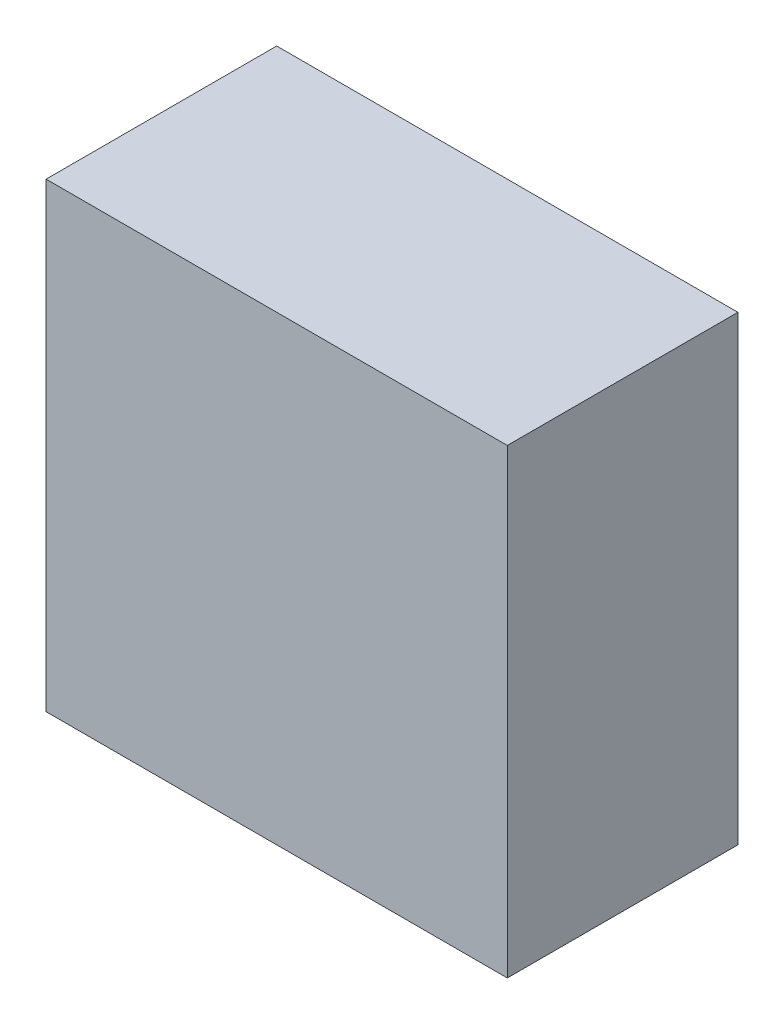
ISO-10303-21;
HEADER;
FILE_DESCRIPTION(('STEP AP214'),'2;1');
FILE_NAME('part.step','',(''),(''),'','','');
FILE_SCHEMA(('AUTOMOTIVE_DESIGN { 1 0 10303 214 1 1 1 1 }'));
ENDSEC;
DATA;
#1=APPLICATION_CONTEXT('core data for automotive mechanical design processes');
#2=APPLICATION_PROTOCOL_DEFINITION('international standard','automotive_design',2000,#1);
#3=PRODUCT_CONTEXT('',#1,'mechanical');
#4=PRODUCT('Part','Part','',(#3));
#5=PRODUCT_RELATED_PRODUCT_CATEGORY('part','',(#4));
#6=PRODUCT_DEFINITION_FORMATION('','',#4);
#7=PRODUCT_DEFINITION_CONTEXT('part definition',#1,'design');
#8=PRODUCT_DEFINITION('design','',#6,#7);
#9=PRODUCT_DEFINITION_SHAPE('','',#8);
#10=(LENGTH_UNIT() NAMED_UNIT(*) SI_UNIT(.MILLI.,.METRE.));
#11=(NAMED_UNIT(*) PLANE_ANGLE_UNIT() SI_UNIT($,.RADIAN.));
#12=(NAMED_UNIT(*) SI_UNIT($,.STERADIAN.) SOLID_ANGLE_UNIT());
#13=UNCERTAINTY_MEASURE_WITH_UNIT(LENGTH_MEASURE(1.E-05),#10,'distance_accuracy_value','');
#14=(GEOMETRIC_REPRESENTATION_CONTEXT(3) GLOBAL_UNCERTAINTY_ASSIGNED_CONTEXT((#13)) GLOBAL_UNIT_ASSIGNED_CONTEXT((#10,
#11,#12)) REPRESENTATION_CONTEXT('',''));
#15=CARTESIAN_POINT('',(0.,0.,0.));
#16=DIRECTION('',(0.,0.,1.));
#17=DIRECTION('',(1.,0.,0.));
#18=AXIS2_PLACEMENT_3D('',#15,#16,#17);
#19=CARTESIAN_POINT('',(0.,0.,2.75));
#20=DIRECTION('',(0.,0.,-1.));
#21=DIRECTION('',(-1.,0.,0.));
#22=AXIS2_PLACEMENT_3D('',#19,#20,#21);
#23=PLANE('',#22);
#24=DIRECTION('',(1.,0.,0.));
#25=VECTOR('',#24,1.);
#26=CARTESIAN_POINT('',(158.313158045854,92.9291158443042,2.75));
#27=LINE('',#26,#25);
#28=CARTESIAN_POINT('',(158.313158045854,92.9291158443042,2.75));
#29=VERTEX_POINT('',#28);
#30=CARTESIAN_POINT('',(154.313158045854,92.9291158443042,2.75));
#31=VERTEX_POINT('',#30);
#32=EDGE_CURVE('E80',#29,#31,#27,.F.);
#33=ORIENTED_EDGE('',*,*,#32,.T.);
#34=DIRECTION('',(0.,1.,0.));
#35=VECTOR('',#34,1.);
#36=CARTESIAN_POINT('',(154.313158045854,92.9291158443042,2.75));
#37=LINE('',#36,#35);
#38=CARTESIAN_POINT('',(154.313158045854,88.9291158443042,2.75));
#39=VERTEX_POINT('',#38);
#40=EDGE_CURVE('E55',#31,#39,#37,.F.);
#41=ORIENTED_EDGE('',*,*,#40,.T.);
#42=DIRECTION('',(1.,0.,0.));
#43=VECTOR('',#42,1.);
#44=CARTESIAN_POINT('',(158.313158045854,88.9291158443042,2.75));
#45=LINE('',#44,#43);
#46=CARTESIAN_POINT('',(158.313158045854,88.9291158443042,2.75));
#47=VERTEX_POINT('',#46);
#48=EDGE_CURVE('E57',#39,#47,#45,.T.);
#49=ORIENTED_EDGE('',*,*,#48,.T.);
#50=DIRECTION('',(0.,1.,0.));
#51=VECTOR('',#50,1.);
#52=CARTESIAN_POINT('',(158.313158045854,92.9291158443042,2.75));
#53=LINE('',#52,#51);
#54=EDGE_CURVE('E20',#47,#29,#53,.T.);
#55=ORIENTED_EDGE('',*,*,#54,.T.);
#56=EDGE_LOOP('',(#33,#41,#49,#55));
#57=FACE_BOUND('',#56,.T.);
#58=ADVANCED_FACE('F17',(#57),#23,.F.);
#59=CARTESIAN_POINT('',(158.313158045854,92.9291158443042,2.75));
#60=DIRECTION('',(-1.,0.,0.));
#61=DIRECTION('',(0.,0.,1.));
#62=AXIS2_PLACEMENT_3D('',#59,#60,#61);
#63=PLANE('',#62);
#64=DIRECTION('',(0.,0.,-1.));
#65=VECTOR('',#64,1.);
#66=CARTESIAN_POINT('',(158.313158045854,92.9291158443042,2.75));
#67=LINE('',#66,#65);
#68=CARTESIAN_POINT('',(158.313158045854,92.9291158443042,0.75));
#69=VERTEX_POINT('',#68);
#70=EDGE_CURVE('E68',#69,#29,#67,.F.);
#71=ORIENTED_EDGE('',*,*,#70,.T.);
#72=ORIENTED_EDGE('',*,*,#54,.F.);
#73=DIRECTION('',(0.,0.,1.));
#74=VECTOR('',#73,1.);
#75=CARTESIAN_POINT('',(158.313158045854,88.9291158443042,2.75));
#76=LINE('',#75,#74);
#77=CARTESIAN_POINT('',(158.313158045854,88.9291158443042,0.75));
#78=VERTEX_POINT('',#77);
#79=EDGE_CURVE('E63',#47,#78,#76,.F.);
#80=ORIENTED_EDGE('',*,*,#79,.T.);
#81=DIRECTION('',(0.,1.,0.));
#82=VECTOR('',#81,1.);
#83=CARTESIAN_POINT('',(158.313158045854,0.,0.75));
#84=LINE('',#83,#82);
#85=EDGE_CURVE('E83',#69,#78,#84,.F.);
#86=ORIENTED_EDGE('',*,*,#85,.F.);
#87=EDGE_LOOP('',(#71,#72,#80,#86));
#88=FACE_BOUND('',#87,.T.);
#89=ADVANCED_FACE('F65',(#88),#63,.F.);
#90=CARTESIAN_POINT('',(158.313158045854,88.9291158443042,2.75));
#91=DIRECTION('',(0.,1.,0.));
#92=DIRECTION('',(0.,0.,1.));
#93=AXIS2_PLACEMENT_3D('',#90,#91,#92);
#94=PLANE('',#93);
#95=ORIENTED_EDGE('',*,*,#79,.F.);
#96=ORIENTED_EDGE('',*,*,#48,.F.);
#97=DIRECTION('',(0.,0.,-1.));
#98=VECTOR('',#97,1.);
#99=CARTESIAN_POINT('',(154.313158045854,88.9291158443042,2.75));
#100=LINE('',#99,#98);
#101=CARTESIAN_POINT('',(154.313158045854,88.9291158443042,0.75));
#102=VERTEX_POINT('',#101);
#103=EDGE_CURVE('E75',#39,#102,#100,.T.);
#104=ORIENTED_EDGE('',*,*,#103,.T.);
#105=DIRECTION('',(-1.,0.,0.));
#106=VECTOR('',#105,1.);
#107=CARTESIAN_POINT('',(0.,88.9291158443042,0.75));
#108=LINE('',#107,#106);
#109=EDGE_CURVE('E72',#78,#102,#108,.T.);
#110=ORIENTED_EDGE('',*,*,#109,.F.);
#111=EDGE_LOOP('',(#95,#96,#104,#110));
#112=FACE_BOUND('',#111,.T.);
#113=ADVANCED_FACE('F70',(#112),#94,.F.);
#114=CARTESIAN_POINT('',(154.313158045854,92.9291158443042,2.75));
#115=DIRECTION('',(1.,0.,0.));
#116=DIRECTION('',(0.,0.,-1.));
#117=AXIS2_PLACEMENT_3D('',#114,#115,#116);
#118=PLANE('',#117);
#119=ORIENTED_EDGE('',*,*,#103,.F.);
#120=ORIENTED_EDGE('',*,*,#40,.F.);
#121=DIRECTION('',(0.,0.,-1.));
#122=VECTOR('',#121,1.);
#123=CARTESIAN_POINT('',(154.313158045854,92.9291158443042,2.75));
#124=LINE('',#123,#122);
#125=CARTESIAN_POINT('',(154.313158045854,92.9291158443042,0.75));
#126=VERTEX_POINT('',#125);
#127=EDGE_CURVE('E35',#31,#126,#124,.T.);
#128=ORIENTED_EDGE('',*,*,#127,.T.);
#129=DIRECTION('',(0.,1.,0.));
#130=VECTOR('',#129,1.);
#131=CARTESIAN_POINT('',(154.313158045854,0.,0.75));
#132=LINE('',#131,#130);
#133=EDGE_CURVE('E26',#102,#126,#132,.T.);
#134=ORIENTED_EDGE('',*,*,#133,.F.);
#135=EDGE_LOOP('',(#119,#120,#128,#134));
#136=FACE_BOUND('',#135,.T.);
#137=ADVANCED_FACE('F89',(#136),#118,.F.);
#138=CARTESIAN_POINT('',(158.313158045854,92.9291158443042,2.75));
#139=DIRECTION('',(0.,-1.,0.));
#140=DIRECTION('',(0.,0.,-1.));
#141=AXIS2_PLACEMENT_3D('',#138,#139,#140);
#142=PLANE('',#141);
#143=ORIENTED_EDGE('',*,*,#127,.F.);
#144=ORIENTED_EDGE('',*,*,#32,.F.);
#145=ORIENTED_EDGE('',*,*,#70,.F.);
#146=DIRECTION('',(-1.,0.,0.));
#147=VECTOR('',#146,1.);
#148=CARTESIAN_POINT('',(0.,92.9291158443042,0.75));
#149=LINE('',#148,#147);
#150=EDGE_CURVE('E11',#126,#69,#149,.F.);
#151=ORIENTED_EDGE('',*,*,#150,.F.);
#152=EDGE_LOOP('',(#143,#144,#145,#151));
#153=FACE_BOUND('',#152,.T.);
#154=ADVANCED_FACE('F91',(#153),#142,.F.);
#155=CARTESIAN_POINT('',(0.,0.,0.75));
#156=DIRECTION('',(0.,0.,-1.));
#157=DIRECTION('',(-1.,0.,0.));
#158=AXIS2_PLACEMENT_3D('',#155,#156,#157);
#159=PLANE('',#158);
#160=ORIENTED_EDGE('',*,*,#133,.T.);
#161=ORIENTED_EDGE('',*,*,#150,.T.);
#162=ORIENTED_EDGE('',*,*,#85,.T.);
#163=ORIENTED_EDGE('',*,*,#109,.T.);
#164=EDGE_LOOP('',(#160,#161,#162,#163));
#165=FACE_BOUND('',#164,.T.);
#166=ADVANCED_FACE('F88',(#165),#159,.T.);
#167=CLOSED_SHELL('',(#58,#89,#113,#137,#154,#166));
#168=MANIFOLD_SOLID_BREP('B1',#167);
#169=ADVANCED_BREP_SHAPE_REPRESENTATION('',(#18,#168),#14);
#170=SHAPE_DEFINITION_REPRESENTATION(#9,#169);
ENDSEC;
END-ISO-10303-21;
